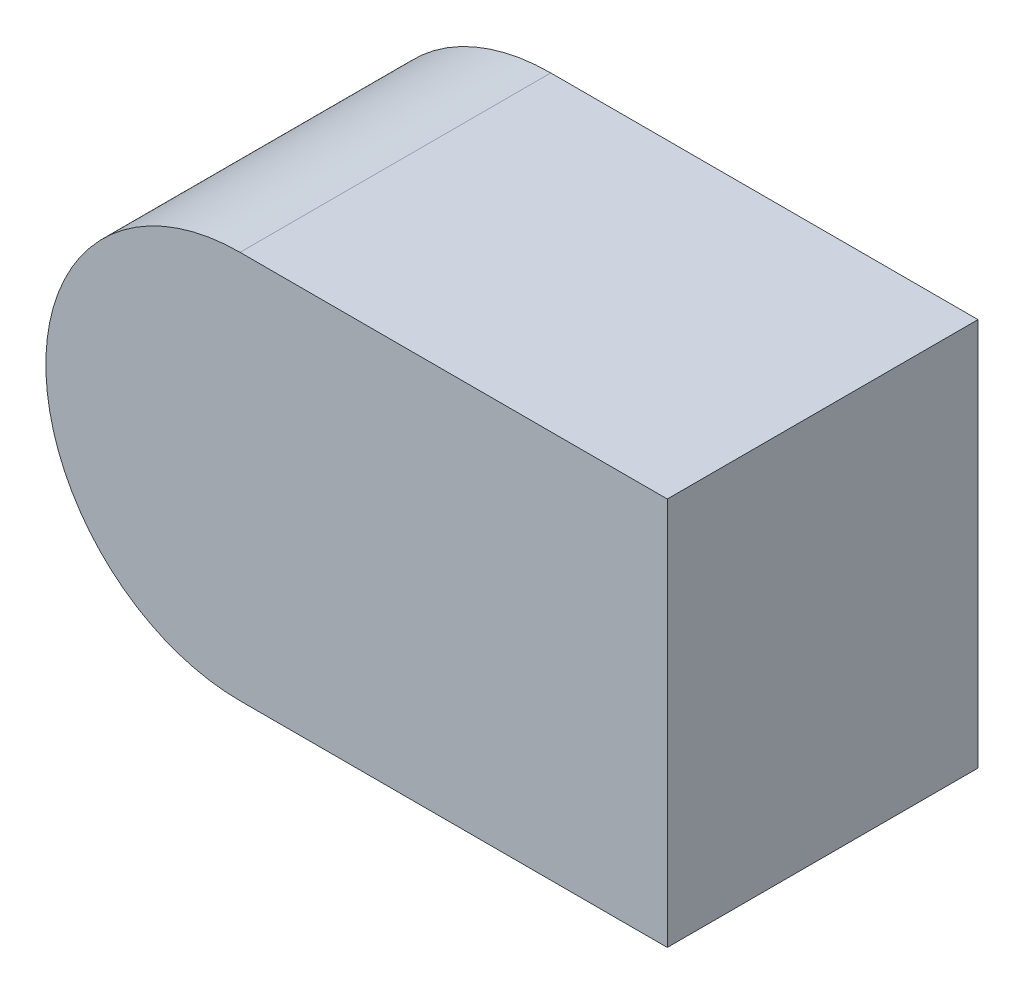
ISO-10303-21;
HEADER;
FILE_DESCRIPTION(('STEP AP214'),'2;1');
FILE_NAME('part.step','',(''),(''),'','','');
FILE_SCHEMA(('AUTOMOTIVE_DESIGN { 1 0 10303 214 1 1 1 1 }'));
ENDSEC;
DATA;
#1=APPLICATION_CONTEXT('core data for automotive mechanical design processes');
#2=APPLICATION_PROTOCOL_DEFINITION('international standard','automotive_design',2000,#1);
#3=PRODUCT_CONTEXT('',#1,'mechanical');
#4=PRODUCT('Part','Part','',(#3));
#5=PRODUCT_RELATED_PRODUCT_CATEGORY('part','',(#4));
#6=PRODUCT_DEFINITION_FORMATION('','',#4);
#7=PRODUCT_DEFINITION_CONTEXT('part definition',#1,'design');
#8=PRODUCT_DEFINITION('design','',#6,#7);
#9=PRODUCT_DEFINITION_SHAPE('','',#8);
#10=(LENGTH_UNIT() NAMED_UNIT(*) SI_UNIT(.MILLI.,.METRE.));
#11=(NAMED_UNIT(*) PLANE_ANGLE_UNIT() SI_UNIT($,.RADIAN.));
#12=(NAMED_UNIT(*) SI_UNIT($,.STERADIAN.) SOLID_ANGLE_UNIT());
#13=UNCERTAINTY_MEASURE_WITH_UNIT(LENGTH_MEASURE(1.E-05),#10,'distance_accuracy_value','');
#14=(GEOMETRIC_REPRESENTATION_CONTEXT(3) GLOBAL_UNCERTAINTY_ASSIGNED_CONTEXT((#13)) GLOBAL_UNIT_ASSIGNED_CONTEXT((#10,
#11,#12)) REPRESENTATION_CONTEXT('',''));
#15=CARTESIAN_POINT('',(0.,0.,0.));
#16=DIRECTION('',(0.,0.,1.));
#17=DIRECTION('',(1.,0.,0.));
#18=AXIS2_PLACEMENT_3D('',#15,#16,#17);
#19=CARTESIAN_POINT('',(1.5,0.625,0.));
#20=DIRECTION('',(0.,1.,0.));
#21=DIRECTION('',(-1.,0.,0.));
#22=AXIS2_PLACEMENT_3D('',#19,#20,#21);
#23=PLANE('',#22);
#24=DIRECTION('',(-1.,0.,0.));
#25=VECTOR('',#24,1.);
#26=CARTESIAN_POINT('',(1.5,0.625,0.));
#27=LINE('',#26,#25);
#28=CARTESIAN_POINT('',(1.5,0.625,0.));
#29=VERTEX_POINT('',#28);
#30=CARTESIAN_POINT('',(1.225,0.625,0.));
#31=VERTEX_POINT('',#30);
#32=EDGE_CURVE('E11',#29,#31,#27,.T.);
#33=ORIENTED_EDGE('',*,*,#32,.T.);
#34=DIRECTION('',(0.,0.,1.));
#35=VECTOR('',#34,1.);
#36=CARTESIAN_POINT('',(1.225,0.625,0.));
#37=LINE('',#36,#35);
#38=CARTESIAN_POINT('',(1.225,0.625,0.2));
#39=VERTEX_POINT('',#38);
#40=EDGE_CURVE('E24',#31,#39,#37,.T.);
#41=ORIENTED_EDGE('',*,*,#40,.T.);
#42=DIRECTION('',(-1.,0.,0.));
#43=VECTOR('',#42,1.);
#44=CARTESIAN_POINT('',(1.5,0.625,0.2));
#45=LINE('',#44,#43);
#46=CARTESIAN_POINT('',(1.5,0.625,0.2));
#47=VERTEX_POINT('',#46);
#48=EDGE_CURVE('E75',#47,#39,#45,.T.);
#49=ORIENTED_EDGE('',*,*,#48,.F.);
#50=DIRECTION('',(0.,0.,1.));
#51=VECTOR('',#50,1.);
#52=CARTESIAN_POINT('',(1.5,0.625,0.));
#53=LINE('',#52,#51);
#54=EDGE_CURVE('E86',#29,#47,#53,.T.);
#55=ORIENTED_EDGE('',*,*,#54,.F.);
#56=EDGE_LOOP('',(#33,#41,#49,#55));
#57=FACE_BOUND('',#56,.T.);
#58=ADVANCED_FACE('F17',(#57),#23,.T.);
#59=CARTESIAN_POINT('',(1.5,0.375,0.));
#60=DIRECTION('',(1.,0.,0.));
#61=DIRECTION('',(0.,1.,0.));
#62=AXIS2_PLACEMENT_3D('',#59,#60,#61);
#63=PLANE('',#62);
#64=DIRECTION('',(0.,1.,0.));
#65=VECTOR('',#64,1.);
#66=CARTESIAN_POINT('',(1.5,0.375,0.));
#67=LINE('',#66,#65);
#68=CARTESIAN_POINT('',(1.5,0.375,0.));
#69=VERTEX_POINT('',#68);
#70=EDGE_CURVE('E83',#69,#29,#67,.T.);
#71=ORIENTED_EDGE('',*,*,#70,.T.);
#72=ORIENTED_EDGE('',*,*,#54,.T.);
#73=DIRECTION('',(0.,1.,0.));
#74=VECTOR('',#73,1.);
#75=CARTESIAN_POINT('',(1.5,0.375,0.2));
#76=LINE('',#75,#74);
#77=CARTESIAN_POINT('',(1.5,0.375,0.2));
#78=VERTEX_POINT('',#77);
#79=EDGE_CURVE('E81',#78,#47,#76,.T.);
#80=ORIENTED_EDGE('',*,*,#79,.F.);
#81=DIRECTION('',(0.,0.,1.));
#82=VECTOR('',#81,1.);
#83=CARTESIAN_POINT('',(1.5,0.375,0.));
#84=LINE('',#83,#82);
#85=EDGE_CURVE('E61',#69,#78,#84,.T.);
#86=ORIENTED_EDGE('',*,*,#85,.F.);
#87=EDGE_LOOP('',(#71,#72,#80,#86));
#88=FACE_BOUND('',#87,.T.);
#89=ADVANCED_FACE('F91',(#88),#63,.T.);
#90=CARTESIAN_POINT('',(1.225,0.375,0.));
#91=DIRECTION('',(0.,-1.,0.));
#92=DIRECTION('',(1.,0.,0.));
#93=AXIS2_PLACEMENT_3D('',#90,#91,#92);
#94=PLANE('',#93);
#95=DIRECTION('',(1.,0.,0.));
#96=VECTOR('',#95,1.);
#97=CARTESIAN_POINT('',(1.225,0.375,0.));
#98=LINE('',#97,#96);
#99=CARTESIAN_POINT('',(1.225,0.375,0.));
#100=VERTEX_POINT('',#99);
#101=EDGE_CURVE('E65',#100,#69,#98,.T.);
#102=ORIENTED_EDGE('',*,*,#101,.T.);
#103=ORIENTED_EDGE('',*,*,#85,.T.);
#104=DIRECTION('',(1.,0.,0.));
#105=VECTOR('',#104,1.);
#106=CARTESIAN_POINT('',(1.225,0.375,0.2));
#107=LINE('',#106,#105);
#108=CARTESIAN_POINT('',(1.225,0.375,0.2));
#109=VERTEX_POINT('',#108);
#110=EDGE_CURVE('E54',#109,#78,#107,.T.);
#111=ORIENTED_EDGE('',*,*,#110,.F.);
#112=DIRECTION('',(0.,0.,1.));
#113=VECTOR('',#112,1.);
#114=CARTESIAN_POINT('',(1.225,0.375,0.));
#115=LINE('',#114,#113);
#116=EDGE_CURVE('E58',#100,#109,#115,.T.);
#117=ORIENTED_EDGE('',*,*,#116,.F.);
#118=EDGE_LOOP('',(#102,#103,#111,#117));
#119=FACE_BOUND('',#118,.T.);
#120=ADVANCED_FACE('F57',(#119),#94,.T.);
#121=CARTESIAN_POINT('',(1.225,0.5,0.));
#122=DIRECTION('',(0.,0.,1.));
#123=DIRECTION('',(0.,1.,0.));
#124=AXIS2_PLACEMENT_3D('',#121,#122,#123);
#125=CYLINDRICAL_SURFACE('',#124,0.125);
#126=CARTESIAN_POINT('',(1.225,0.5,0.));
#127=DIRECTION('',(0.,0.,1.));
#128=DIRECTION('',(0.,1.,0.));
#129=AXIS2_PLACEMENT_3D('',#126,#127,#128);
#130=CIRCLE('',#129,0.125);
#131=EDGE_CURVE('E71',#31,#100,#130,.T.);
#132=ORIENTED_EDGE('',*,*,#131,.T.);
#133=ORIENTED_EDGE('',*,*,#116,.T.);
#134=CARTESIAN_POINT('',(1.225,0.5,0.2));
#135=DIRECTION('',(0.,0.,1.));
#136=DIRECTION('',(0.,1.,0.));
#137=AXIS2_PLACEMENT_3D('',#134,#135,#136);
#138=CIRCLE('',#137,0.125);
#139=EDGE_CURVE('E70',#39,#109,#138,.T.);
#140=ORIENTED_EDGE('',*,*,#139,.F.);
#141=ORIENTED_EDGE('',*,*,#40,.F.);
#142=EDGE_LOOP('',(#132,#133,#140,#141));
#143=FACE_BOUND('',#142,.T.);
#144=ADVANCED_FACE('F69',(#143),#125,.T.);
#145=CARTESIAN_POINT('',(1.3,0.5,0.2));
#146=DIRECTION('',(0.,0.,1.));
#147=DIRECTION('',(1.,0.,0.));
#148=AXIS2_PLACEMENT_3D('',#145,#146,#147);
#149=PLANE('',#148);
#150=ORIENTED_EDGE('',*,*,#139,.T.);
#151=ORIENTED_EDGE('',*,*,#110,.T.);
#152=ORIENTED_EDGE('',*,*,#79,.T.);
#153=ORIENTED_EDGE('',*,*,#48,.T.);
#154=EDGE_LOOP('',(#150,#151,#152,#153));
#155=FACE_BOUND('',#154,.T.);
#156=ADVANCED_FACE('F74',(#155),#149,.T.);
#157=CARTESIAN_POINT('',(1.3,0.5,0.));
#158=DIRECTION('',(0.,0.,1.));
#159=DIRECTION('',(1.,0.,0.));
#160=AXIS2_PLACEMENT_3D('',#157,#158,#159);
#161=PLANE('',#160);
#162=ORIENTED_EDGE('',*,*,#131,.F.);
#163=ORIENTED_EDGE('',*,*,#32,.F.);
#164=ORIENTED_EDGE('',*,*,#70,.F.);
#165=ORIENTED_EDGE('',*,*,#101,.F.);
#166=EDGE_LOOP('',(#162,#163,#164,#165));
#167=FACE_BOUND('',#166,.T.);
#168=ADVANCED_FACE('F89',(#167),#161,.F.);
#169=CLOSED_SHELL('',(#58,#89,#120,#144,#156,#168));
#170=MANIFOLD_SOLID_BREP('B1',#169);
#171=ADVANCED_BREP_SHAPE_REPRESENTATION('',(#18,#170),#14);
#172=SHAPE_DEFINITION_REPRESENTATION(#9,#171);
ENDSEC;
END-ISO-10303-21;
